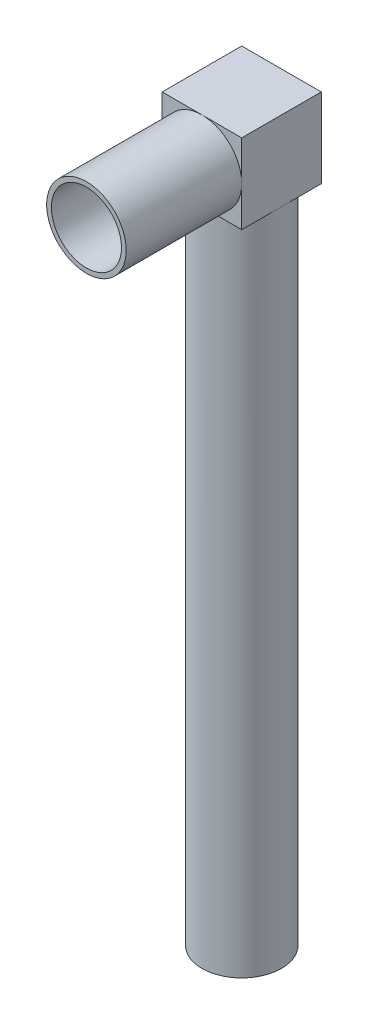
ISO-10303-21;
HEADER;
FILE_DESCRIPTION(('STEP AP214'),'2;1');
FILE_NAME('part.step','',(''),(''),'','','');
FILE_SCHEMA(('AUTOMOTIVE_DESIGN { 1 0 10303 214 1 1 1 1 }'));
ENDSEC;
DATA;
#1=APPLICATION_CONTEXT('core data for automotive mechanical design processes');
#2=APPLICATION_PROTOCOL_DEFINITION('international standard','automotive_design',2000,#1);
#3=PRODUCT_CONTEXT('',#1,'mechanical');
#4=PRODUCT('Part','Part','',(#3));
#5=PRODUCT_RELATED_PRODUCT_CATEGORY('part','',(#4));
#6=PRODUCT_DEFINITION_FORMATION('','',#4);
#7=PRODUCT_DEFINITION_CONTEXT('part definition',#1,'design');
#8=PRODUCT_DEFINITION('design','',#6,#7);
#9=PRODUCT_DEFINITION_SHAPE('','',#8);
#10=(LENGTH_UNIT() NAMED_UNIT(*) SI_UNIT(.MILLI.,.METRE.));
#11=(NAMED_UNIT(*) PLANE_ANGLE_UNIT() SI_UNIT($,.RADIAN.));
#12=(NAMED_UNIT(*) SI_UNIT($,.STERADIAN.) SOLID_ANGLE_UNIT());
#13=UNCERTAINTY_MEASURE_WITH_UNIT(LENGTH_MEASURE(1.E-05),#10,'distance_accuracy_value','');
#14=(GEOMETRIC_REPRESENTATION_CONTEXT(3) GLOBAL_UNCERTAINTY_ASSIGNED_CONTEXT((#13)) GLOBAL_UNIT_ASSIGNED_CONTEXT((#10,
#11,#12)) REPRESENTATION_CONTEXT('',''));
#15=CARTESIAN_POINT('',(0.,0.,0.));
#16=DIRECTION('',(0.,0.,1.));
#17=DIRECTION('',(1.,0.,0.));
#18=AXIS2_PLACEMENT_3D('',#15,#16,#17);
#19=CARTESIAN_POINT('',(21.1,-21.1,-44.7));
#20=DIRECTION('',(0.,1.,0.));
#21=DIRECTION('',(0.,0.,1.));
#22=AXIS2_PLACEMENT_3D('',#19,#20,#21);
#23=PLANE('',#22);
#24=CARTESIAN_POINT('',(0.,-21.1,-23.6));
#25=DIRECTION('',(0.,-1.,0.));
#26=DIRECTION('',(0.,0.,-1.));
#27=AXIS2_PLACEMENT_3D('',#24,#25,#26);
#28=CIRCLE('',#27,21.1);
#29=CARTESIAN_POINT('',(0.,-21.1,-2.5));
#30=VERTEX_POINT('',#29);
#31=CARTESIAN_POINT('',(-21.1,-21.1,-23.6));
#32=VERTEX_POINT('',#31);
#33=EDGE_CURVE('E376',#30,#32,#28,.T.);
#34=ORIENTED_EDGE('',*,*,#33,.F.);
#35=DIRECTION('',(-1.,0.,0.));
#36=VECTOR('',#35,1.);
#37=CARTESIAN_POINT('',(21.1,-21.1,-2.5));
#38=LINE('',#37,#36);
#39=CARTESIAN_POINT('',(-21.1,-21.1,-2.5));
#40=VERTEX_POINT('',#39);
#41=EDGE_CURVE('E258',#30,#40,#38,.T.);
#42=ORIENTED_EDGE('',*,*,#41,.T.);
#43=DIRECTION('',(0.,0.,1.));
#44=VECTOR('',#43,1.);
#45=CARTESIAN_POINT('',(-21.1,-21.1,-44.7));
#46=LINE('',#45,#44);
#47=EDGE_CURVE('E246',#32,#40,#46,.T.);
#48=ORIENTED_EDGE('',*,*,#47,.F.);
#49=EDGE_LOOP('',(#34,#42,#48));
#50=FACE_BOUND('',#49,.T.);
#51=ADVANCED_FACE('F37',(#50),#23,.F.);
#52=CARTESIAN_POINT('',(0.,-21.1,-44.7));
#53=VERTEX_POINT('',#52);
#54=EDGE_CURVE('E223',#32,#53,#28,.T.);
#55=ORIENTED_EDGE('',*,*,#54,.F.);
#56=CARTESIAN_POINT('',(-21.1,-21.1,-44.7));
#57=VERTEX_POINT('',#56);
#58=EDGE_CURVE('E260',#57,#32,#46,.T.);
#59=ORIENTED_EDGE('',*,*,#58,.F.);
#60=DIRECTION('',(-1.,0.,0.));
#61=VECTOR('',#60,1.);
#62=CARTESIAN_POINT('',(21.1,-21.1,-44.7));
#63=LINE('',#62,#61);
#64=EDGE_CURVE('E242',#53,#57,#63,.T.);
#65=ORIENTED_EDGE('',*,*,#64,.F.);
#66=EDGE_LOOP('',(#55,#59,#65));
#67=FACE_BOUND('',#66,.T.);
#68=ADVANCED_FACE('F327',(#67),#23,.F.);
#69=CARTESIAN_POINT('',(16.7725396744416,-21.1,-40.3725396744416));
#70=DIRECTION('',(0.,-1.,0.));
#71=DIRECTION('',(0.,0.,-1.));
#72=AXIS2_PLACEMENT_3D('',#69,#70,#71);
#73=CIRCLE('',#72,1.82746032555838);
#74=CARTESIAN_POINT('',(16.7725396744416,-21.1,-42.2));
#75=VERTEX_POINT('',#74);
#76=EDGE_CURVE('E362',#75,#75,#73,.T.);
#77=ORIENTED_EDGE('',*,*,#76,.F.);
#78=EDGE_LOOP('',(#77));
#79=FACE_BOUND('',#78,.T.);
#80=CARTESIAN_POINT('',(21.1,-21.1,-23.6));
#81=VERTEX_POINT('',#80);
#82=EDGE_CURVE('E230',#53,#81,#28,.T.);
#83=ORIENTED_EDGE('',*,*,#82,.F.);
#84=CARTESIAN_POINT('',(21.1,-21.1,-44.7));
#85=VERTEX_POINT('',#84);
#86=EDGE_CURVE('E243',#85,#53,#63,.T.);
#87=ORIENTED_EDGE('',*,*,#86,.F.);
#88=DIRECTION('',(0.,0.,1.));
#89=VECTOR('',#88,1.);
#90=CARTESIAN_POINT('',(21.1,-21.1,-44.7));
#91=LINE('',#90,#89);
#92=EDGE_CURVE('E264',#85,#81,#91,.T.);
#93=ORIENTED_EDGE('',*,*,#92,.T.);
#94=EDGE_LOOP('',(#83,#87,#93));
#95=FACE_BOUND('',#94,.T.);
#96=ADVANCED_FACE('F334',(#79,#95),#23,.F.);
#97=CARTESIAN_POINT('',(0.,0.,58.8));
#98=DIRECTION('',(0.,0.,1.));
#99=DIRECTION('',(1.,0.,0.));
#100=AXIS2_PLACEMENT_3D('',#97,#98,#99);
#101=PLANE('',#100);
#102=CARTESIAN_POINT('',(0.,0.,58.8));
#103=DIRECTION('',(0.,0.,1.));
#104=DIRECTION('',(1.,0.,0.));
#105=AXIS2_PLACEMENT_3D('',#102,#103,#104);
#106=CIRCLE('',#105,21.1);
#107=CARTESIAN_POINT('',(21.1,0.,58.8));
#108=VERTEX_POINT('',#107);
#109=EDGE_CURVE('E282',#108,#108,#106,.T.);
#110=ORIENTED_EDGE('',*,*,#109,.T.);
#111=EDGE_LOOP('',(#110));
#112=FACE_BOUND('',#111,.T.);
#113=CARTESIAN_POINT('',(0.,0.,58.8));
#114=DIRECTION('',(0.,0.,1.));
#115=DIRECTION('',(1.,0.,0.));
#116=AXIS2_PLACEMENT_3D('',#113,#114,#115);
#117=CIRCLE('',#116,18.6);
#118=CARTESIAN_POINT('',(18.6,0.,58.8));
#119=VERTEX_POINT('',#118);
#120=EDGE_CURVE('E279',#119,#119,#117,.T.);
#121=ORIENTED_EDGE('',*,*,#120,.F.);
#122=EDGE_LOOP('',(#121));
#123=FACE_BOUND('',#122,.T.);
#124=ADVANCED_FACE('F353',(#112,#123),#101,.T.);
#125=CARTESIAN_POINT('',(0.,0.,58.8));
#126=DIRECTION('',(0.,0.,-1.));
#127=DIRECTION('',(-1.,0.,0.));
#128=AXIS2_PLACEMENT_3D('',#125,#126,#127);
#129=CYLINDRICAL_SURFACE('',#128,21.1);
#130=ORIENTED_EDGE('',*,*,#109,.F.);
#131=EDGE_LOOP('',(#130));
#132=FACE_BOUND('',#131,.T.);
#133=CARTESIAN_POINT('',(0.,0.,-2.5));
#134=DIRECTION('',(0.,0.,-1.));
#135=DIRECTION('',(-1.,0.,0.));
#136=AXIS2_PLACEMENT_3D('',#133,#134,#135);
#137=CIRCLE('',#136,21.1);
#138=CARTESIAN_POINT('',(-21.1,0.,-2.5));
#139=VERTEX_POINT('',#138);
#140=CARTESIAN_POINT('',(0.,21.1,-2.5));
#141=VERTEX_POINT('',#140);
#142=EDGE_CURVE('E274',#139,#141,#137,.T.);
#143=ORIENTED_EDGE('',*,*,#142,.F.);
#144=EDGE_CURVE('E273',#30,#139,#137,.T.);
#145=ORIENTED_EDGE('',*,*,#144,.F.);
#146=CARTESIAN_POINT('',(21.1,0.,-2.5));
#147=VERTEX_POINT('',#146);
#148=EDGE_CURVE('E386',#147,#30,#137,.T.);
#149=ORIENTED_EDGE('',*,*,#148,.F.);
#150=EDGE_CURVE('E278',#141,#147,#137,.T.);
#151=ORIENTED_EDGE('',*,*,#150,.F.);
#152=EDGE_LOOP('',(#143,#145,#149,#151));
#153=FACE_BOUND('',#152,.T.);
#154=ADVANCED_FACE('F39',(#132,#153),#129,.T.);
#155=CARTESIAN_POINT('',(0.,0.,58.8));
#156=DIRECTION('',(0.,0.,-1.));
#157=DIRECTION('',(-1.,0.,0.));
#158=AXIS2_PLACEMENT_3D('',#155,#156,#157);
#159=CYLINDRICAL_SURFACE('',#158,18.6);
#160=ORIENTED_EDGE('',*,*,#120,.T.);
#161=EDGE_LOOP('',(#160));
#162=FACE_BOUND('',#161,.T.);
#163=CARTESIAN_POINT('',(0.,0.,0.));
#164=DIRECTION('',(0.,0.,1.));
#165=DIRECTION('',(1.,0.,0.));
#166=AXIS2_PLACEMENT_3D('',#163,#164,#165);
#167=CIRCLE('',#166,18.6);
#168=CARTESIAN_POINT('',(18.6,0.,0.));
#169=VERTEX_POINT('',#168);
#170=EDGE_CURVE('E277',#169,#169,#167,.T.);
#171=ORIENTED_EDGE('',*,*,#170,.F.);
#172=EDGE_LOOP('',(#171));
#173=FACE_BOUND('',#172,.T.);
#174=ADVANCED_FACE('F434',(#162,#173),#159,.F.);
#175=CARTESIAN_POINT('',(0.,0.,0.));
#176=DIRECTION('',(0.,0.,-1.));
#177=DIRECTION('',(-1.,0.,0.));
#178=AXIS2_PLACEMENT_3D('',#175,#176,#177);
#179=PLANE('',#178);
#180=CARTESIAN_POINT('',(0.,0.,0.));
#181=DIRECTION('',(0.,0.,1.));
#182=DIRECTION('',(1.,0.,0.));
#183=AXIS2_PLACEMENT_3D('',#180,#181,#182);
#184=CIRCLE('',#183,15.);
#185=CARTESIAN_POINT('',(15.,0.,0.));
#186=VERTEX_POINT('',#185);
#187=EDGE_CURVE('E182',#186,#186,#184,.T.);
#188=ORIENTED_EDGE('',*,*,#187,.F.);
#189=EDGE_LOOP('',(#188));
#190=FACE_BOUND('',#189,.T.);
#191=ORIENTED_EDGE('',*,*,#170,.T.);
#192=EDGE_LOOP('',(#191));
#193=FACE_BOUND('',#192,.T.);
#194=ADVANCED_FACE('F414',(#190,#193),#179,.F.);
#195=CARTESIAN_POINT('',(0.,0.,-2.5));
#196=DIRECTION('',(0.,0.,1.));
#197=DIRECTION('',(1.,0.,0.));
#198=AXIS2_PLACEMENT_3D('',#195,#196,#197);
#199=PLANE('',#198);
#200=DIRECTION('',(0.,1.,0.));
#201=VECTOR('',#200,1.);
#202=CARTESIAN_POINT('',(-21.1,-21.1,-2.5));
#203=LINE('',#202,#201);
#204=CARTESIAN_POINT('',(-21.1,21.1,-2.5));
#205=VERTEX_POINT('',#204);
#206=EDGE_CURVE('E229',#139,#205,#203,.T.);
#207=ORIENTED_EDGE('',*,*,#206,.F.);
#208=ORIENTED_EDGE('',*,*,#142,.T.);
#209=DIRECTION('',(1.,0.,0.));
#210=VECTOR('',#209,1.);
#211=CARTESIAN_POINT('',(21.1,21.1,-2.5));
#212=LINE('',#211,#210);
#213=EDGE_CURVE('E251',#205,#141,#212,.T.);
#214=ORIENTED_EDGE('',*,*,#213,.F.);
#215=EDGE_LOOP('',(#207,#208,#214));
#216=FACE_BOUND('',#215,.T.);
#217=ADVANCED_FACE('F405',(#216),#199,.T.);
#218=CARTESIAN_POINT('',(21.1,21.1,-2.5));
#219=VERTEX_POINT('',#218);
#220=EDGE_CURVE('E250',#141,#219,#212,.T.);
#221=ORIENTED_EDGE('',*,*,#220,.F.);
#222=ORIENTED_EDGE('',*,*,#150,.T.);
#223=DIRECTION('',(0.,-1.,0.));
#224=VECTOR('',#223,1.);
#225=CARTESIAN_POINT('',(21.1,-21.1,-2.5));
#226=LINE('',#225,#224);
#227=EDGE_CURVE('E255',#219,#147,#226,.T.);
#228=ORIENTED_EDGE('',*,*,#227,.F.);
#229=EDGE_LOOP('',(#221,#222,#228));
#230=FACE_BOUND('',#229,.T.);
#231=ADVANCED_FACE('F402',(#230),#199,.T.);
#232=CARTESIAN_POINT('',(21.1,-21.1,-2.5));
#233=VERTEX_POINT('',#232);
#234=EDGE_CURVE('E254',#147,#233,#226,.T.);
#235=ORIENTED_EDGE('',*,*,#234,.F.);
#236=ORIENTED_EDGE('',*,*,#148,.T.);
#237=EDGE_CURVE('E238',#233,#30,#38,.T.);
#238=ORIENTED_EDGE('',*,*,#237,.F.);
#239=EDGE_LOOP('',(#235,#236,#238));
#240=FACE_BOUND('',#239,.T.);
#241=ADVANCED_FACE('F385',(#240),#199,.T.);
#242=CARTESIAN_POINT('',(-21.1,-21.1,-44.7));
#243=DIRECTION('',(1.,0.,0.));
#244=DIRECTION('',(0.,0.,-1.));
#245=AXIS2_PLACEMENT_3D('',#242,#243,#244);
#246=PLANE('',#245);
#247=EDGE_CURVE('E247',#40,#139,#203,.T.);
#248=ORIENTED_EDGE('',*,*,#247,.T.);
#249=ORIENTED_EDGE('',*,*,#206,.T.);
#250=DIRECTION('',(0.,0.,1.));
#251=VECTOR('',#250,1.);
#252=CARTESIAN_POINT('',(-21.1,21.1,-44.7));
#253=LINE('',#252,#251);
#254=CARTESIAN_POINT('',(-21.1,21.1,-44.7));
#255=VERTEX_POINT('',#254);
#256=EDGE_CURVE('E270',#255,#205,#253,.T.);
#257=ORIENTED_EDGE('',*,*,#256,.F.);
#258=DIRECTION('',(0.,1.,0.));
#259=VECTOR('',#258,1.);
#260=CARTESIAN_POINT('',(-21.1,-21.1,-44.7));
#261=LINE('',#260,#259);
#262=EDGE_CURVE('E234',#57,#255,#261,.T.);
#263=ORIENTED_EDGE('',*,*,#262,.F.);
#264=ORIENTED_EDGE('',*,*,#58,.T.);
#265=ORIENTED_EDGE('',*,*,#47,.T.);
#266=EDGE_LOOP('',(#248,#249,#257,#263,#264,#265));
#267=FACE_BOUND('',#266,.T.);
#268=ADVANCED_FACE('F396',(#267),#246,.F.);
#269=CARTESIAN_POINT('',(21.1,21.1,-44.7));
#270=DIRECTION('',(0.,-1.,0.));
#271=DIRECTION('',(0.,0.,-1.));
#272=AXIS2_PLACEMENT_3D('',#269,#270,#271);
#273=PLANE('',#272);
#274=ORIENTED_EDGE('',*,*,#213,.T.);
#275=ORIENTED_EDGE('',*,*,#220,.T.);
#276=DIRECTION('',(0.,0.,1.));
#277=VECTOR('',#276,1.);
#278=CARTESIAN_POINT('',(21.1,21.1,-44.7));
#279=LINE('',#278,#277);
#280=CARTESIAN_POINT('',(21.1,21.1,-44.7));
#281=VERTEX_POINT('',#280);
#282=EDGE_CURVE('E267',#281,#219,#279,.T.);
#283=ORIENTED_EDGE('',*,*,#282,.F.);
#284=DIRECTION('',(1.,0.,0.));
#285=VECTOR('',#284,1.);
#286=CARTESIAN_POINT('',(21.1,21.1,-44.7));
#287=LINE('',#286,#285);
#288=EDGE_CURVE('E237',#255,#281,#287,.T.);
#289=ORIENTED_EDGE('',*,*,#288,.F.);
#290=ORIENTED_EDGE('',*,*,#256,.T.);
#291=EDGE_LOOP('',(#274,#275,#283,#289,#290));
#292=FACE_BOUND('',#291,.T.);
#293=ADVANCED_FACE('F350',(#292),#273,.F.);
#294=CARTESIAN_POINT('',(21.1,-21.1,-44.7));
#295=DIRECTION('',(-1.,0.,0.));
#296=DIRECTION('',(0.,0.,1.));
#297=AXIS2_PLACEMENT_3D('',#294,#295,#296);
#298=PLANE('',#297);
#299=ORIENTED_EDGE('',*,*,#227,.T.);
#300=ORIENTED_EDGE('',*,*,#234,.T.);
#301=EDGE_CURVE('E263',#81,#233,#91,.T.);
#302=ORIENTED_EDGE('',*,*,#301,.F.);
#303=ORIENTED_EDGE('',*,*,#92,.F.);
#304=DIRECTION('',(0.,-1.,0.));
#305=VECTOR('',#304,1.);
#306=CARTESIAN_POINT('',(21.1,-21.1,-44.7));
#307=LINE('',#306,#305);
#308=EDGE_CURVE('E240',#281,#85,#307,.T.);
#309=ORIENTED_EDGE('',*,*,#308,.F.);
#310=ORIENTED_EDGE('',*,*,#282,.T.);
#311=EDGE_LOOP('',(#299,#300,#302,#303,#309,#310));
#312=FACE_BOUND('',#311,.T.);
#313=ADVANCED_FACE('F341',(#312),#298,.F.);
#314=EDGE_CURVE('E233',#81,#30,#28,.T.);
#315=ORIENTED_EDGE('',*,*,#314,.F.);
#316=ORIENTED_EDGE('',*,*,#301,.T.);
#317=ORIENTED_EDGE('',*,*,#237,.T.);
#318=EDGE_LOOP('',(#315,#316,#317));
#319=FACE_BOUND('',#318,.T.);
#320=ADVANCED_FACE('F330',(#319),#23,.F.);
#321=CARTESIAN_POINT('',(0.,0.,-44.7));
#322=DIRECTION('',(0.,0.,1.));
#323=DIRECTION('',(1.,0.,0.));
#324=AXIS2_PLACEMENT_3D('',#321,#322,#323);
#325=PLANE('',#324);
#326=DIRECTION('',(1.,0.,0.));
#327=VECTOR('',#326,1.);
#328=CARTESIAN_POINT('',(18.6,18.6,-44.7));
#329=LINE('',#328,#327);
#330=CARTESIAN_POINT('',(-18.6,18.6,-44.7));
#331=VERTEX_POINT('',#330);
#332=CARTESIAN_POINT('',(18.6,18.6,-44.7));
#333=VERTEX_POINT('',#332);
#334=EDGE_CURVE('E188',#331,#333,#329,.T.);
#335=ORIENTED_EDGE('',*,*,#334,.F.);
#336=DIRECTION('',(0.,1.,0.));
#337=VECTOR('',#336,1.);
#338=CARTESIAN_POINT('',(-18.6,-18.6,-44.7));
#339=LINE('',#338,#337);
#340=CARTESIAN_POINT('',(-18.6,-18.6,-44.7));
#341=VERTEX_POINT('',#340);
#342=EDGE_CURVE('E159',#341,#331,#339,.T.);
#343=ORIENTED_EDGE('',*,*,#342,.F.);
#344=DIRECTION('',(-1.,0.,0.));
#345=VECTOR('',#344,1.);
#346=CARTESIAN_POINT('',(18.6,-18.6,-44.7));
#347=LINE('',#346,#345);
#348=CARTESIAN_POINT('',(18.6,-18.6,-44.7));
#349=VERTEX_POINT('',#348);
#350=EDGE_CURVE('E176',#349,#341,#347,.T.);
#351=ORIENTED_EDGE('',*,*,#350,.F.);
#352=DIRECTION('',(0.,-1.,0.));
#353=VECTOR('',#352,1.);
#354=CARTESIAN_POINT('',(18.6,-18.6,-44.7));
#355=LINE('',#354,#353);
#356=EDGE_CURVE('E179',#333,#349,#355,.T.);
#357=ORIENTED_EDGE('',*,*,#356,.F.);
#358=EDGE_LOOP('',(#335,#343,#351,#357));
#359=FACE_BOUND('',#358,.T.);
#360=ORIENTED_EDGE('',*,*,#262,.T.);
#361=ORIENTED_EDGE('',*,*,#288,.T.);
#362=ORIENTED_EDGE('',*,*,#308,.T.);
#363=ORIENTED_EDGE('',*,*,#86,.T.);
#364=ORIENTED_EDGE('',*,*,#64,.T.);
#365=EDGE_LOOP('',(#360,#361,#362,#363,#364));
#366=FACE_BOUND('',#365,.T.);
#367=ADVANCED_FACE('F340',(#359,#366),#325,.F.);
#368=ORIENTED_EDGE('',*,*,#41,.F.);
#369=ORIENTED_EDGE('',*,*,#144,.T.);
#370=ORIENTED_EDGE('',*,*,#247,.F.);
#371=EDGE_LOOP('',(#368,#369,#370));
#372=FACE_BOUND('',#371,.T.);
#373=ADVANCED_FACE('F347',(#372),#199,.T.);
#374=CARTESIAN_POINT('',(0.,-371.1,-23.6));
#375=DIRECTION('',(0.,1.,0.));
#376=DIRECTION('',(0.,0.,1.));
#377=AXIS2_PLACEMENT_3D('',#374,#375,#376);
#378=CYLINDRICAL_SURFACE('',#377,21.1);
#379=CARTESIAN_POINT('',(0.,-371.1,-23.6));
#380=DIRECTION('',(0.,-1.,0.));
#381=DIRECTION('',(0.,0.,-1.));
#382=AXIS2_PLACEMENT_3D('',#379,#380,#381);
#383=CIRCLE('',#382,21.1);
#384=CARTESIAN_POINT('',(0.,-371.1,-44.7));
#385=VERTEX_POINT('',#384);
#386=EDGE_CURVE('E226',#385,#385,#383,.T.);
#387=ORIENTED_EDGE('',*,*,#386,.F.);
#388=EDGE_LOOP('',(#387));
#389=FACE_BOUND('',#388,.T.);
#390=ORIENTED_EDGE('',*,*,#82,.T.);
#391=ORIENTED_EDGE('',*,*,#314,.T.);
#392=ORIENTED_EDGE('',*,*,#33,.T.);
#393=ORIENTED_EDGE('',*,*,#54,.T.);
#394=EDGE_LOOP('',(#390,#391,#392,#393));
#395=FACE_BOUND('',#394,.T.);
#396=ADVANCED_FACE('F375',(#389,#395),#378,.T.);
#397=CARTESIAN_POINT('',(0.,-371.1,-23.6));
#398=DIRECTION('',(0.,-1.,0.));
#399=DIRECTION('',(0.,0.,-1.));
#400=AXIS2_PLACEMENT_3D('',#397,#398,#399);
#401=PLANE('',#400);
#402=CARTESIAN_POINT('',(0.,-371.1,-23.6));
#403=DIRECTION('',(0.,-1.,0.));
#404=DIRECTION('',(0.,0.,-1.));
#405=AXIS2_PLACEMENT_3D('',#402,#403,#404);
#406=CIRCLE('',#405,6.025);
#407=CARTESIAN_POINT('',(0.,-371.1,-29.625));
#408=VERTEX_POINT('',#407);
#409=EDGE_CURVE('E195',#408,#408,#406,.T.);
#410=ORIENTED_EDGE('',*,*,#409,.F.);
#411=EDGE_LOOP('',(#410));
#412=FACE_BOUND('',#411,.T.);
#413=ORIENTED_EDGE('',*,*,#386,.T.);
#414=EDGE_LOOP('',(#413));
#415=FACE_BOUND('',#414,.T.);
#416=ADVANCED_FACE('F410',(#412,#415),#401,.T.);
#417=CARTESIAN_POINT('',(0.,-364.9,-23.6));
#418=DIRECTION('',(0.,-1.,0.));
#419=DIRECTION('',(0.,0.,-1.));
#420=AXIS2_PLACEMENT_3D('',#417,#418,#419);
#421=PLANE('',#420);
#422=CARTESIAN_POINT('',(0.,-364.9,-23.6));
#423=DIRECTION('',(0.,-1.,0.));
#424=DIRECTION('',(0.,0.,-1.));
#425=AXIS2_PLACEMENT_3D('',#422,#423,#424);
#426=CIRCLE('',#425,6.025);
#427=CARTESIAN_POINT('',(0.,-364.9,-29.625));
#428=VERTEX_POINT('',#427);
#429=EDGE_CURVE('E201',#428,#428,#426,.T.);
#430=ORIENTED_EDGE('',*,*,#429,.T.);
#431=EDGE_LOOP('',(#430));
#432=FACE_BOUND('',#431,.T.);
#433=CARTESIAN_POINT('',(0.,-364.9,-23.6));
#434=DIRECTION('',(0.,-1.,0.));
#435=DIRECTION('',(0.,0.,-1.));
#436=AXIS2_PLACEMENT_3D('',#433,#434,#435);
#437=CIRCLE('',#436,3.015);
#438=CARTESIAN_POINT('',(1.68529670978139,-364.9,-21.1));
#439=VERTEX_POINT('',#438);
#440=CARTESIAN_POINT('',(-1.68529670978139,-364.9,-21.1));
#441=VERTEX_POINT('',#440);
#442=EDGE_CURVE('E209',#439,#441,#437,.F.);
#443=ORIENTED_EDGE('',*,*,#442,.T.);
#444=DIRECTION('',(1.,0.,0.));
#445=VECTOR('',#444,1.);
#446=CARTESIAN_POINT('',(1.68529670978139,-364.9,-21.1));
#447=LINE('',#446,#445);
#448=CARTESIAN_POINT('',(-1.6583123951777,-364.9,-21.1));
#449=VERTEX_POINT('',#448);
#450=EDGE_CURVE('E208',#441,#449,#447,.T.);
#451=ORIENTED_EDGE('',*,*,#450,.T.);
#452=CARTESIAN_POINT('',(0.,-364.9,-23.6));
#453=DIRECTION('',(0.,-1.,0.));
#454=DIRECTION('',(0.,0.,-1.));
#455=AXIS2_PLACEMENT_3D('',#452,#453,#454);
#456=CIRCLE('',#455,3.);
#457=CARTESIAN_POINT('',(1.6583123951777,-364.9,-21.1));
#458=VERTEX_POINT('',#457);
#459=EDGE_CURVE('E11',#449,#458,#456,.F.);
#460=ORIENTED_EDGE('',*,*,#459,.T.);
#461=EDGE_CURVE('E204',#458,#439,#447,.T.);
#462=ORIENTED_EDGE('',*,*,#461,.T.);
#463=EDGE_LOOP('',(#443,#451,#460,#462));
#464=FACE_BOUND('',#463,.T.);
#465=ADVANCED_FACE('F304',(#432,#464),#421,.T.);
#466=CARTESIAN_POINT('',(0.,-364.9,-23.6));
#467=DIRECTION('',(0.,-1.,0.));
#468=DIRECTION('',(0.,0.,-1.));
#469=AXIS2_PLACEMENT_3D('',#466,#467,#468);
#470=CYLINDRICAL_SURFACE('',#469,6.025);
#471=ORIENTED_EDGE('',*,*,#429,.F.);
#472=EDGE_LOOP('',(#471));
#473=FACE_BOUND('',#472,.T.);
#474=ORIENTED_EDGE('',*,*,#409,.T.);
#475=EDGE_LOOP('',(#474));
#476=FACE_BOUND('',#475,.T.);
#477=ADVANCED_FACE('F314',(#473,#476),#470,.F.);
#478=CARTESIAN_POINT('',(0.,-349.6,-23.6));
#479=DIRECTION('',(0.,1.,0.));
#480=DIRECTION('',(0.,0.,1.));
#481=AXIS2_PLACEMENT_3D('',#478,#479,#480);
#482=PLANE('',#481);
#483=CARTESIAN_POINT('',(0.,-349.6,-23.6));
#484=DIRECTION('',(0.,-1.,0.));
#485=DIRECTION('',(0.,0.,1.));
#486=AXIS2_PLACEMENT_3D('',#483,#484,#485);
#487=CIRCLE('',#486,3.015);
#488=CARTESIAN_POINT('',(-1.68529670978139,-349.6,-21.1));
#489=VERTEX_POINT('',#488);
#490=CARTESIAN_POINT('',(1.68529670978139,-349.6,-21.1));
#491=VERTEX_POINT('',#490);
#492=EDGE_CURVE('E213',#489,#491,#487,.T.);
#493=ORIENTED_EDGE('',*,*,#492,.T.);
#494=DIRECTION('',(-1.,0.,0.));
#495=VECTOR('',#494,1.);
#496=CARTESIAN_POINT('',(1.68529670978139,-349.6,-21.1));
#497=LINE('',#496,#495);
#498=EDGE_CURVE('E216',#491,#489,#497,.T.);
#499=ORIENTED_EDGE('',*,*,#498,.T.);
#500=EDGE_LOOP('',(#493,#499));
#501=FACE_BOUND('',#500,.T.);
#502=ADVANCED_FACE('F311',(#501),#482,.F.);
#503=CARTESIAN_POINT('',(0.,-361.6,-23.6));
#504=DIRECTION('',(0.,-1.,0.));
#505=DIRECTION('',(0.,0.,-1.));
#506=AXIS2_PLACEMENT_3D('',#503,#504,#505);
#507=PLANE('',#506);
#508=DIRECTION('',(1.,0.,0.));
#509=VECTOR('',#508,1.);
#510=CARTESIAN_POINT('',(1.68529670978139,-361.6,-21.1));
#511=LINE('',#510,#509);
#512=CARTESIAN_POINT('',(-1.6583123951777,-361.6,-21.1));
#513=VERTEX_POINT('',#512);
#514=CARTESIAN_POINT('',(1.6583123951777,-361.6,-21.1));
#515=VERTEX_POINT('',#514);
#516=EDGE_CURVE('E287',#513,#515,#511,.T.);
#517=ORIENTED_EDGE('',*,*,#516,.T.);
#518=CARTESIAN_POINT('',(0.,-361.6,-23.6));
#519=DIRECTION('',(0.,-1.,0.));
#520=DIRECTION('',(0.,0.,-1.));
#521=AXIS2_PLACEMENT_3D('',#518,#519,#520);
#522=CIRCLE('',#521,3.);
#523=EDGE_CURVE('E211',#515,#513,#522,.T.);
#524=ORIENTED_EDGE('',*,*,#523,.T.);
#525=EDGE_LOOP('',(#517,#524));
#526=FACE_BOUND('',#525,.T.);
#527=ADVANCED_FACE('F313',(#526),#507,.T.);
#528=CARTESIAN_POINT('',(0.,-361.6,-23.6));
#529=DIRECTION('',(0.,-1.,0.));
#530=DIRECTION('',(0.,0.,-1.));
#531=AXIS2_PLACEMENT_3D('',#528,#529,#530);
#532=CYLINDRICAL_SURFACE('',#531,3.);
#533=ORIENTED_EDGE('',*,*,#459,.F.);
#534=DIRECTION('',(0.,-1.,0.));
#535=VECTOR('',#534,1.);
#536=CARTESIAN_POINT('',(-1.6583123951777,-361.6,-21.1));
#537=LINE('',#536,#535);
#538=EDGE_CURVE('E45',#513,#449,#537,.T.);
#539=ORIENTED_EDGE('',*,*,#538,.F.);
#540=ORIENTED_EDGE('',*,*,#523,.F.);
#541=DIRECTION('',(0.,-1.,0.));
#542=VECTOR('',#541,1.);
#543=CARTESIAN_POINT('',(1.6583123951777,-361.6,-21.1));
#544=LINE('',#543,#542);
#545=EDGE_CURVE('E290',#458,#515,#544,.F.);
#546=ORIENTED_EDGE('',*,*,#545,.F.);
#547=EDGE_LOOP('',(#533,#539,#540,#546));
#548=FACE_BOUND('',#547,.T.);
#549=ADVANCED_FACE('F300',(#548),#532,.F.);
#550=CARTESIAN_POINT('',(1.68529670978139,-349.6,-21.1));
#551=DIRECTION('',(0.,0.,1.));
#552=DIRECTION('',(1.,0.,0.));
#553=AXIS2_PLACEMENT_3D('',#550,#551,#552);
#554=PLANE('',#553);
#555=ORIENTED_EDGE('',*,*,#450,.F.);
#556=DIRECTION('',(0.,-1.,0.));
#557=VECTOR('',#556,1.);
#558=CARTESIAN_POINT('',(-1.68529670978139,-349.6,-21.1));
#559=LINE('',#558,#557);
#560=EDGE_CURVE('E220',#489,#441,#559,.T.);
#561=ORIENTED_EDGE('',*,*,#560,.F.);
#562=ORIENTED_EDGE('',*,*,#498,.F.);
#563=DIRECTION('',(0.,-1.,0.));
#564=VECTOR('',#563,1.);
#565=CARTESIAN_POINT('',(1.68529670978139,-349.6,-21.1));
#566=LINE('',#565,#564);
#567=EDGE_CURVE('E219',#491,#439,#566,.T.);
#568=ORIENTED_EDGE('',*,*,#567,.T.);
#569=ORIENTED_EDGE('',*,*,#461,.F.);
#570=ORIENTED_EDGE('',*,*,#545,.T.);
#571=ORIENTED_EDGE('',*,*,#516,.F.);
#572=ORIENTED_EDGE('',*,*,#538,.T.);
#573=EDGE_LOOP('',(#555,#561,#562,#568,#569,#570,#571,#572));
#574=FACE_BOUND('',#573,.T.);
#575=ADVANCED_FACE('F296',(#574),#554,.F.);
#576=CARTESIAN_POINT('',(0.,-349.6,-23.6));
#577=DIRECTION('',(0.,-1.,0.));
#578=DIRECTION('',(0.,0.,-1.));
#579=AXIS2_PLACEMENT_3D('',#576,#577,#578);
#580=CYLINDRICAL_SURFACE('',#579,3.015);
#581=ORIENTED_EDGE('',*,*,#442,.F.);
#582=ORIENTED_EDGE('',*,*,#567,.F.);
#583=ORIENTED_EDGE('',*,*,#492,.F.);
#584=ORIENTED_EDGE('',*,*,#560,.T.);
#585=EDGE_LOOP('',(#581,#582,#583,#584));
#586=FACE_BOUND('',#585,.T.);
#587=ADVANCED_FACE('F309',(#586),#580,.F.);
#588=CARTESIAN_POINT('',(-18.6,-18.6,-5.));
#589=DIRECTION('',(-1.,0.,0.));
#590=DIRECTION('',(0.,0.,1.));
#591=AXIS2_PLACEMENT_3D('',#588,#589,#590);
#592=PLANE('',#591);
#593=ORIENTED_EDGE('',*,*,#342,.T.);
#594=DIRECTION('',(0.,0.,-1.));
#595=VECTOR('',#594,1.);
#596=CARTESIAN_POINT('',(-18.6,18.6,-5.));
#597=LINE('',#596,#595);
#598=CARTESIAN_POINT('',(-18.6,18.6,-5.));
#599=VERTEX_POINT('',#598);
#600=EDGE_CURVE('E152',#599,#331,#597,.T.);
#601=ORIENTED_EDGE('',*,*,#600,.F.);
#602=DIRECTION('',(0.,1.,0.));
#603=VECTOR('',#602,1.);
#604=CARTESIAN_POINT('',(-18.6,-18.6,-5.));
#605=LINE('',#604,#603);
#606=CARTESIAN_POINT('',(-18.6,-18.6,-5.));
#607=VERTEX_POINT('',#606);
#608=EDGE_CURVE('E156',#607,#599,#605,.T.);
#609=ORIENTED_EDGE('',*,*,#608,.F.);
#610=DIRECTION('',(0.,0.,-1.));
#611=VECTOR('',#610,1.);
#612=CARTESIAN_POINT('',(-18.6,-18.6,-5.));
#613=LINE('',#612,#611);
#614=EDGE_CURVE('E193',#607,#341,#613,.T.);
#615=ORIENTED_EDGE('',*,*,#614,.T.);
#616=EDGE_LOOP('',(#593,#601,#609,#615));
#617=FACE_BOUND('',#616,.T.);
#618=ADVANCED_FACE('F154',(#617),#592,.F.);
#619=CARTESIAN_POINT('',(18.6,-18.6,-5.));
#620=DIRECTION('',(0.,-1.,0.));
#621=DIRECTION('',(0.,0.,-1.));
#622=AXIS2_PLACEMENT_3D('',#619,#620,#621);
#623=PLANE('',#622);
#624=DIRECTION('',(0.,0.,-1.));
#625=VECTOR('',#624,1.);
#626=CARTESIAN_POINT('',(18.6,-18.6,-5.));
#627=LINE('',#626,#625);
#628=CARTESIAN_POINT('',(18.6,-18.6,-5.));
#629=VERTEX_POINT('',#628);
#630=CARTESIAN_POINT('',(18.6,-18.6,-23.6));
#631=VERTEX_POINT('',#630);
#632=EDGE_CURVE('E196',#629,#631,#627,.T.);
#633=ORIENTED_EDGE('',*,*,#632,.T.);
#634=CARTESIAN_POINT('',(0.654104292134881,-18.6,-23.6));
#635=DIRECTION('',(0.,-1.,0.));
#636=DIRECTION('',(0.,0.,-1.));
#637=AXIS2_PLACEMENT_3D('',#634,#635,#636);
#638=CIRCLE('',#637,17.9458957078651);
#639=EDGE_CURVE('E50',#631,#631,#638,.T.);
#640=ORIENTED_EDGE('',*,*,#639,.T.);
#641=CARTESIAN_POINT('',(18.6,-18.6,-40.3725396744416));
#642=VERTEX_POINT('',#641);
#643=EDGE_CURVE('E56',#631,#642,#627,.T.);
#644=ORIENTED_EDGE('',*,*,#643,.T.);
#645=CARTESIAN_POINT('',(16.7725396744416,-18.6,-40.3725396744416));
#646=DIRECTION('',(0.,-1.,0.));
#647=DIRECTION('',(0.,0.,-1.));
#648=AXIS2_PLACEMENT_3D('',#645,#646,#647);
#649=CIRCLE('',#648,1.82746032555838);
#650=EDGE_CURVE('E664',#642,#642,#649,.T.);
#651=ORIENTED_EDGE('',*,*,#650,.T.);
#652=EDGE_CURVE('E199',#642,#349,#627,.T.);
#653=ORIENTED_EDGE('',*,*,#652,.T.);
#654=ORIENTED_EDGE('',*,*,#350,.T.);
#655=ORIENTED_EDGE('',*,*,#614,.F.);
#656=DIRECTION('',(-1.,0.,0.));
#657=VECTOR('',#656,1.);
#658=CARTESIAN_POINT('',(18.6,-18.6,-5.));
#659=LINE('',#658,#657);
#660=EDGE_CURVE('E164',#629,#607,#659,.T.);
#661=ORIENTED_EDGE('',*,*,#660,.F.);
#662=EDGE_LOOP('',(#633,#640,#644,#651,#653,#654,#655,#661));
#663=FACE_BOUND('',#662,.T.);
#664=ADVANCED_FACE('F580',(#663),#623,.F.);
#665=CARTESIAN_POINT('',(18.6,-18.6,-5.));
#666=DIRECTION('',(1.,0.,0.));
#667=DIRECTION('',(0.,0.,-1.));
#668=AXIS2_PLACEMENT_3D('',#665,#666,#667);
#669=PLANE('',#668);
#670=ORIENTED_EDGE('',*,*,#356,.T.);
#671=ORIENTED_EDGE('',*,*,#652,.F.);
#672=ORIENTED_EDGE('',*,*,#643,.F.);
#673=ORIENTED_EDGE('',*,*,#632,.F.);
#674=DIRECTION('',(0.,-1.,0.));
#675=VECTOR('',#674,1.);
#676=CARTESIAN_POINT('',(18.6,-18.6,-5.));
#677=LINE('',#676,#675);
#678=CARTESIAN_POINT('',(18.6,18.6,-5.));
#679=VERTEX_POINT('',#678);
#680=EDGE_CURVE('E172',#679,#629,#677,.T.);
#681=ORIENTED_EDGE('',*,*,#680,.F.);
#682=DIRECTION('',(0.,0.,-1.));
#683=VECTOR('',#682,1.);
#684=CARTESIAN_POINT('',(18.6,18.6,-5.));
#685=LINE('',#684,#683);
#686=EDGE_CURVE('E163',#679,#333,#685,.T.);
#687=ORIENTED_EDGE('',*,*,#686,.T.);
#688=EDGE_LOOP('',(#670,#671,#672,#673,#681,#687));
#689=FACE_BOUND('',#688,.T.);
#690=ADVANCED_FACE('F588',(#689),#669,.F.);
#691=CARTESIAN_POINT('',(18.6,18.6,-5.));
#692=DIRECTION('',(0.,1.,0.));
#693=DIRECTION('',(0.,0.,1.));
#694=AXIS2_PLACEMENT_3D('',#691,#692,#693);
#695=PLANE('',#694);
#696=ORIENTED_EDGE('',*,*,#334,.T.);
#697=ORIENTED_EDGE('',*,*,#686,.F.);
#698=DIRECTION('',(1.,0.,0.));
#699=VECTOR('',#698,1.);
#700=CARTESIAN_POINT('',(18.6,18.6,-5.));
#701=LINE('',#700,#699);
#702=EDGE_CURVE('E167',#599,#679,#701,.T.);
#703=ORIENTED_EDGE('',*,*,#702,.F.);
#704=ORIENTED_EDGE('',*,*,#600,.T.);
#705=EDGE_LOOP('',(#696,#697,#703,#704));
#706=FACE_BOUND('',#705,.T.);
#707=ADVANCED_FACE('F168',(#706),#695,.F.);
#708=CARTESIAN_POINT('',(0.,0.,-5.));
#709=DIRECTION('',(0.,0.,1.));
#710=DIRECTION('',(1.,0.,0.));
#711=AXIS2_PLACEMENT_3D('',#708,#709,#710);
#712=PLANE('',#711);
#713=CARTESIAN_POINT('',(0.,0.,-5.));
#714=DIRECTION('',(0.,0.,1.));
#715=DIRECTION('',(1.,0.,0.));
#716=AXIS2_PLACEMENT_3D('',#713,#714,#715);
#717=CIRCLE('',#716,15.);
#718=CARTESIAN_POINT('',(15.,0.,-5.));
#719=VERTEX_POINT('',#718);
#720=EDGE_CURVE('E189',#719,#719,#717,.T.);
#721=ORIENTED_EDGE('',*,*,#720,.T.);
#722=EDGE_LOOP('',(#721));
#723=FACE_BOUND('',#722,.T.);
#724=ORIENTED_EDGE('',*,*,#608,.T.);
#725=ORIENTED_EDGE('',*,*,#702,.T.);
#726=ORIENTED_EDGE('',*,*,#680,.T.);
#727=ORIENTED_EDGE('',*,*,#660,.T.);
#728=EDGE_LOOP('',(#724,#725,#726,#727));
#729=FACE_BOUND('',#728,.T.);
#730=ADVANCED_FACE('F174',(#723,#729),#712,.F.);
#731=CARTESIAN_POINT('',(0.,0.,-5.));
#732=DIRECTION('',(0.,0.,1.));
#733=DIRECTION('',(1.,0.,0.));
#734=AXIS2_PLACEMENT_3D('',#731,#732,#733);
#735=CYLINDRICAL_SURFACE('',#734,15.);
#736=ORIENTED_EDGE('',*,*,#720,.F.);
#737=EDGE_LOOP('',(#736));
#738=FACE_BOUND('',#737,.T.);
#739=ORIENTED_EDGE('',*,*,#187,.T.);
#740=EDGE_LOOP('',(#739));
#741=FACE_BOUND('',#740,.T.);
#742=ADVANCED_FACE('F610',(#738,#741),#735,.F.);
#743=CARTESIAN_POINT('',(16.7725396744416,-18.6,-40.3725396744416));
#744=DIRECTION('',(0.,-1.,0.));
#745=DIRECTION('',(0.,0.,-1.));
#746=AXIS2_PLACEMENT_3D('',#743,#744,#745);
#747=CYLINDRICAL_SURFACE('',#746,1.82746032555838);
#748=ORIENTED_EDGE('',*,*,#650,.F.);
#749=EDGE_LOOP('',(#748));
#750=FACE_BOUND('',#749,.T.);
#751=ORIENTED_EDGE('',*,*,#76,.T.);
#752=EDGE_LOOP('',(#751));
#753=FACE_BOUND('',#752,.T.);
#754=ADVANCED_FACE('F618',(#750,#753),#747,.F.);
#755=CARTESIAN_POINT('',(0.654104292134881,-18.6,-23.6));
#756=DIRECTION('',(0.,-1.,0.));
#757=DIRECTION('',(0.,0.,-1.));
#758=AXIS2_PLACEMENT_3D('',#755,#756,#757);
#759=CYLINDRICAL_SURFACE('',#758,17.9458957078651);
#760=ORIENTED_EDGE('',*,*,#639,.F.);
#761=EDGE_LOOP('',(#760));
#762=FACE_BOUND('',#761,.T.);
#763=CARTESIAN_POINT('',(0.654104292134881,-21.1,-23.6));
#764=DIRECTION('',(0.,-1.,0.));
#765=DIRECTION('',(0.,0.,-1.));
#766=AXIS2_PLACEMENT_3D('',#763,#764,#765);
#767=CIRCLE('',#766,17.9458957078651);
#768=CARTESIAN_POINT('',(0.654104292134881,-21.1,-41.5458957078651));
#769=VERTEX_POINT('',#768);
#770=EDGE_CURVE('E659',#769,#769,#767,.T.);
#771=ORIENTED_EDGE('',*,*,#770,.T.);
#772=EDGE_LOOP('',(#771));
#773=FACE_BOUND('',#772,.T.);
#774=ADVANCED_FACE('F626',(#762,#773),#759,.F.);
#775=CARTESIAN_POINT('',(0.654104292134881,-21.1,-23.6));
#776=DIRECTION('',(0.,-1.,0.));
#777=DIRECTION('',(0.,0.,-1.));
#778=AXIS2_PLACEMENT_3D('',#775,#776,#777);
#779=PLANE('',#778);
#780=ORIENTED_EDGE('',*,*,#770,.F.);
#781=EDGE_LOOP('',(#780));
#782=FACE_BOUND('',#781,.T.);
#783=ADVANCED_FACE('F634',(#782),#779,.F.);
#784=CLOSED_SHELL('',(#51,#68,#96,#124,#154,#174,#194,#217,#231,#241,#268,#293,#313,#320,#367,
#373,#396,#416,#465,#477,#502,#527,#549,#575,#587,#618,#664,#690,#707,#730,#742,#754,#774,#783));
#785=MANIFOLD_SOLID_BREP('B2',#784);
#786=ADVANCED_BREP_SHAPE_REPRESENTATION('',(#18,#785),#14);
#787=SHAPE_DEFINITION_REPRESENTATION(#9,#786);
ENDSEC;
END-ISO-10303-21;
